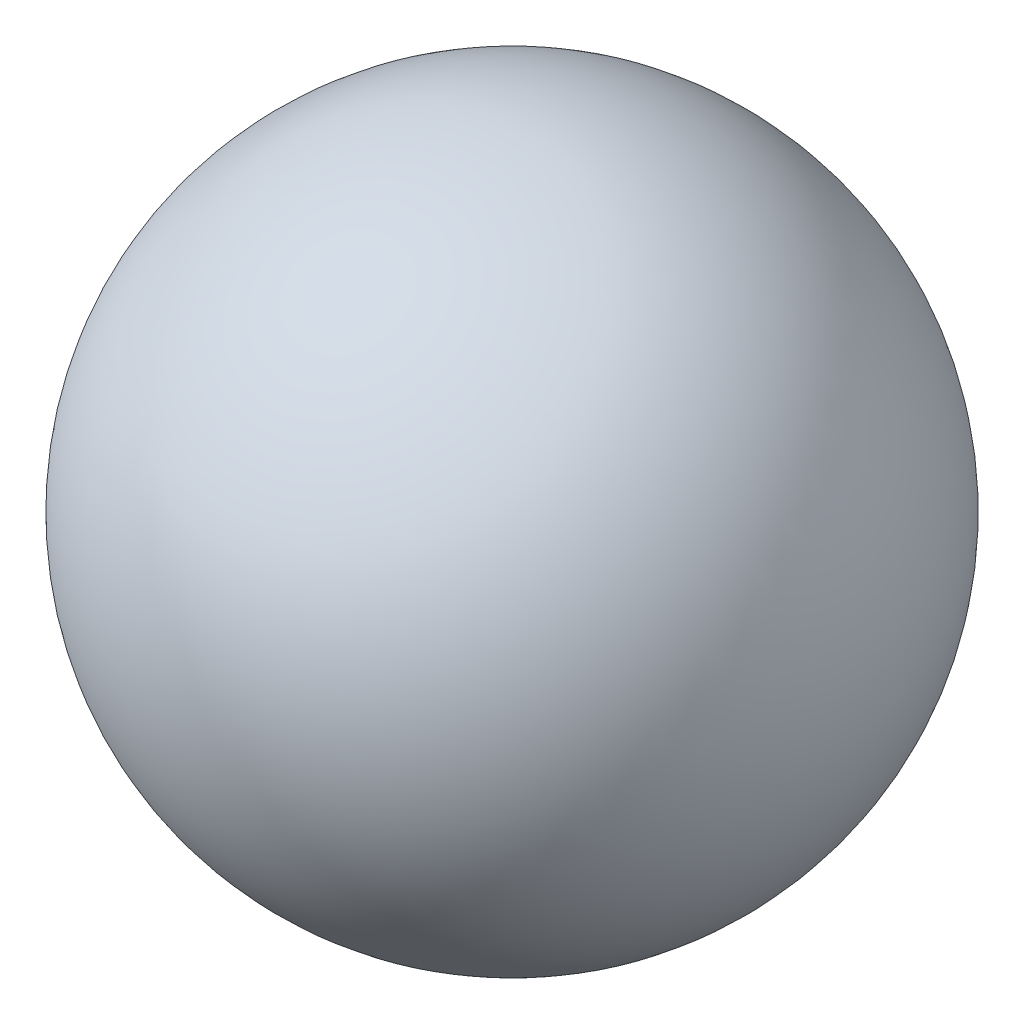
ISO-10303-21;
HEADER;
FILE_DESCRIPTION(('STEP AP214'),'2;1');
FILE_NAME('part.step','',(''),(''),'','','');
FILE_SCHEMA(('AUTOMOTIVE_DESIGN { 1 0 10303 214 1 1 1 1 }'));
ENDSEC;
DATA;
#1=APPLICATION_CONTEXT('core data for automotive mechanical design processes');
#2=APPLICATION_PROTOCOL_DEFINITION('international standard','automotive_design',2000,#1);
#3=PRODUCT_CONTEXT('',#1,'mechanical');
#4=PRODUCT('Part','Part','',(#3));
#5=PRODUCT_RELATED_PRODUCT_CATEGORY('part','',(#4));
#6=PRODUCT_DEFINITION_FORMATION('','',#4);
#7=PRODUCT_DEFINITION_CONTEXT('part definition',#1,'design');
#8=PRODUCT_DEFINITION('design','',#6,#7);
#9=PRODUCT_DEFINITION_SHAPE('','',#8);
#10=(LENGTH_UNIT() NAMED_UNIT(*) SI_UNIT(.MILLI.,.METRE.));
#11=(NAMED_UNIT(*) PLANE_ANGLE_UNIT() SI_UNIT($,.RADIAN.));
#12=(NAMED_UNIT(*) SI_UNIT($,.STERADIAN.) SOLID_ANGLE_UNIT());
#13=UNCERTAINTY_MEASURE_WITH_UNIT(LENGTH_MEASURE(1.E-05),#10,'distance_accuracy_value','');
#14=(GEOMETRIC_REPRESENTATION_CONTEXT(3) GLOBAL_UNCERTAINTY_ASSIGNED_CONTEXT((#13)) GLOBAL_UNIT_ASSIGNED_CONTEXT((#10,
#11,#12)) REPRESENTATION_CONTEXT('',''));
#15=CARTESIAN_POINT('',(0.,0.,0.));
#16=DIRECTION('',(0.,0.,1.));
#17=DIRECTION('',(1.,0.,0.));
#18=AXIS2_PLACEMENT_3D('',#15,#16,#17);
#19=CARTESIAN_POINT('',(0.,0.,0.));
#20=DIRECTION('',(0.,1.,0.));
#21=DIRECTION('',(1.,0.,0.));
#22=AXIS2_PLACEMENT_3D('',#19,#20,#21);
#23=SPHERICAL_SURFACE('',#22,25.);
#24=CARTESIAN_POINT('',(0.,25.,0.));
#25=VERTEX_POINT('',#24);
#26=VERTEX_LOOP('',#25);
#27=FACE_BOUND('',#26,.T.);
#28=ADVANCED_FACE('F31',(#27),#23,.T.);
#29=CLOSED_SHELL('',(#28));
#30=MANIFOLD_SOLID_BREP('B2',#29);
#31=ADVANCED_BREP_SHAPE_REPRESENTATION('',(#18,#30),#14);
#32=SHAPE_DEFINITION_REPRESENTATION(#9,#31);
ENDSEC;
END-ISO-10303-21;
